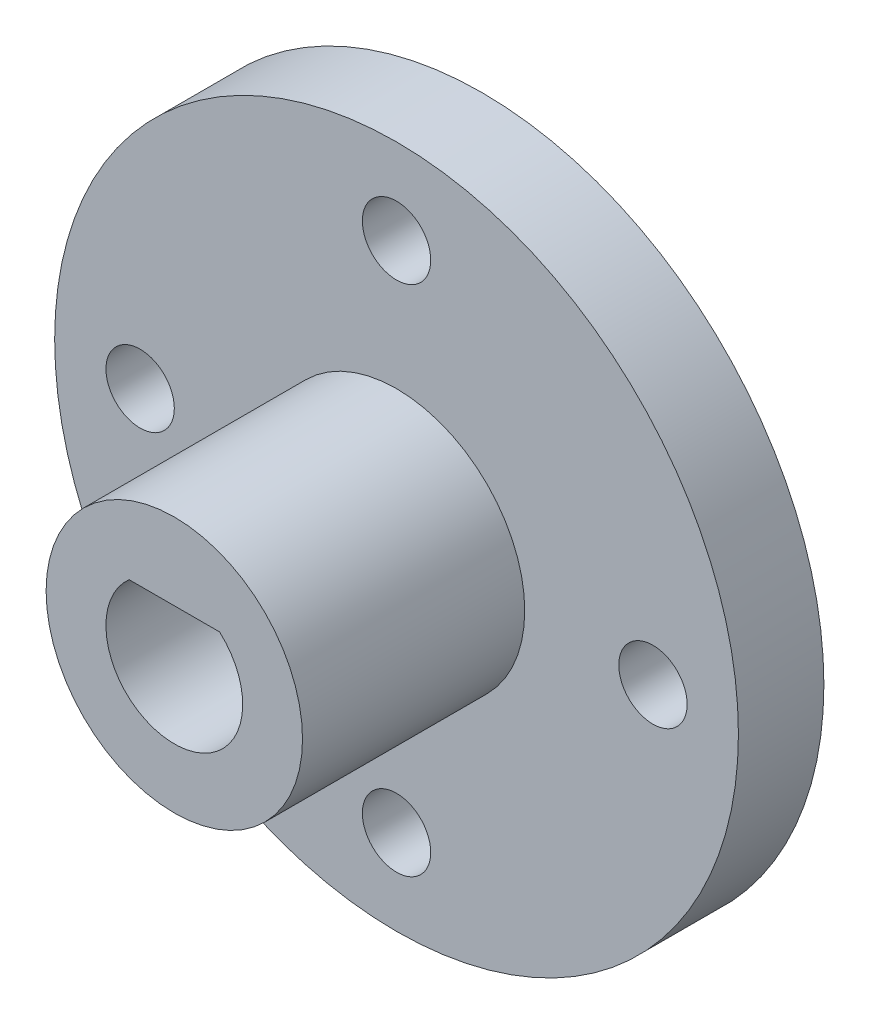
ISO-10303-21;
HEADER;
FILE_DESCRIPTION(('STEP AP214'),'2;1');
FILE_NAME('part.step','',(''),(''),'','','');
FILE_SCHEMA(('AUTOMOTIVE_DESIGN { 1 0 10303 214 1 1 1 1 }'));
ENDSEC;
DATA;
#1=APPLICATION_CONTEXT('core data for automotive mechanical design processes');
#2=APPLICATION_PROTOCOL_DEFINITION('international standard','automotive_design',2000,#1);
#3=PRODUCT_CONTEXT('',#1,'mechanical');
#4=PRODUCT('Part','Part','',(#3));
#5=PRODUCT_RELATED_PRODUCT_CATEGORY('part','',(#4));
#6=PRODUCT_DEFINITION_FORMATION('','',#4);
#7=PRODUCT_DEFINITION_CONTEXT('part definition',#1,'design');
#8=PRODUCT_DEFINITION('design','',#6,#7);
#9=PRODUCT_DEFINITION_SHAPE('','',#8);
#10=(LENGTH_UNIT() NAMED_UNIT(*) SI_UNIT(.MILLI.,.METRE.));
#11=(NAMED_UNIT(*) PLANE_ANGLE_UNIT() SI_UNIT($,.RADIAN.));
#12=(NAMED_UNIT(*) SI_UNIT($,.STERADIAN.) SOLID_ANGLE_UNIT());
#13=UNCERTAINTY_MEASURE_WITH_UNIT(LENGTH_MEASURE(1.E-05),#10,'distance_accuracy_value','');
#14=(GEOMETRIC_REPRESENTATION_CONTEXT(3) GLOBAL_UNCERTAINTY_ASSIGNED_CONTEXT((#13)) GLOBAL_UNIT_ASSIGNED_CONTEXT((#10,
#11,#12)) REPRESENTATION_CONTEXT('',''));
#15=CARTESIAN_POINT('',(0.,0.,0.));
#16=DIRECTION('',(0.,0.,1.));
#17=DIRECTION('',(1.,0.,0.));
#18=AXIS2_PLACEMENT_3D('',#15,#16,#17);
#19=CARTESIAN_POINT('',(0.,0.,5.));
#20=DIRECTION('',(0.,0.,-1.));
#21=DIRECTION('',(-1.,0.,0.));
#22=AXIS2_PLACEMENT_3D('',#19,#20,#21);
#23=CYLINDRICAL_SURFACE('',#22,20.);
#24=CARTESIAN_POINT('',(0.,0.,5.));
#25=DIRECTION('',(0.,0.,1.));
#26=DIRECTION('',(1.,0.,0.));
#27=AXIS2_PLACEMENT_3D('',#24,#25,#26);
#28=CIRCLE('',#27,20.);
#29=CARTESIAN_POINT('',(20.,0.,5.));
#30=VERTEX_POINT('',#29);
#31=EDGE_CURVE('E52',#30,#30,#28,.T.);
#32=ORIENTED_EDGE('',*,*,#31,.F.);
#33=EDGE_LOOP('',(#32));
#34=FACE_BOUND('',#33,.T.);
#35=CARTESIAN_POINT('',(0.,0.,0.));
#36=DIRECTION('',(0.,0.,1.));
#37=DIRECTION('',(1.,0.,0.));
#38=AXIS2_PLACEMENT_3D('',#35,#36,#37);
#39=CIRCLE('',#38,20.);
#40=CARTESIAN_POINT('',(20.,0.,0.));
#41=VERTEX_POINT('',#40);
#42=EDGE_CURVE('E101',#41,#41,#39,.T.);
#43=ORIENTED_EDGE('',*,*,#42,.T.);
#44=EDGE_LOOP('',(#43));
#45=FACE_BOUND('',#44,.T.);
#46=ADVANCED_FACE('F43',(#34,#45),#23,.T.);
#47=CARTESIAN_POINT('',(0.,0.,5.));
#48=DIRECTION('',(0.,0.,1.));
#49=DIRECTION('',(1.,0.,0.));
#50=AXIS2_PLACEMENT_3D('',#47,#48,#49);
#51=PLANE('',#50);
#52=CARTESIAN_POINT('',(0.,15.,5.));
#53=DIRECTION('',(0.,0.,1.));
#54=DIRECTION('',(1.,0.,0.));
#55=AXIS2_PLACEMENT_3D('',#52,#53,#54);
#56=CIRCLE('',#55,2.);
#57=CARTESIAN_POINT('',(2.,15.,5.));
#58=VERTEX_POINT('',#57);
#59=EDGE_CURVE('E114',#58,#58,#56,.T.);
#60=ORIENTED_EDGE('',*,*,#59,.F.);
#61=EDGE_LOOP('',(#60));
#62=FACE_BOUND('',#61,.T.);
#63=CARTESIAN_POINT('',(15.0000000000004,4.23570186157979E-13,5.));
#64=DIRECTION('',(0.,0.,1.));
#65=DIRECTION('',(1.,0.,0.));
#66=AXIS2_PLACEMENT_3D('',#63,#64,#65);
#67=CIRCLE('',#66,2.00000000000033);
#68=CARTESIAN_POINT('',(17.0000000000008,4.23570186157979E-13,5.));
#69=VERTEX_POINT('',#68);
#70=EDGE_CURVE('E187',#69,#69,#67,.T.);
#71=ORIENTED_EDGE('',*,*,#70,.F.);
#72=EDGE_LOOP('',(#71));
#73=FACE_BOUND('',#72,.T.);
#74=CARTESIAN_POINT('',(8.47140372315957E-13,-15.,5.));
#75=DIRECTION('',(0.,0.,1.));
#76=DIRECTION('',(1.,0.,0.));
#77=AXIS2_PLACEMENT_3D('',#74,#75,#76);
#78=CIRCLE('',#77,2.00000000000091);
#79=CARTESIAN_POINT('',(2.00000000000176,-15.,5.));
#80=VERTEX_POINT('',#79);
#81=EDGE_CURVE('E183',#80,#80,#78,.T.);
#82=ORIENTED_EDGE('',*,*,#81,.F.);
#83=EDGE_LOOP('',(#82));
#84=FACE_BOUND('',#83,.T.);
#85=CARTESIAN_POINT('',(-14.9999999999996,-4.254071563567E-13,5.));
#86=DIRECTION('',(0.,0.,1.));
#87=DIRECTION('',(1.,0.,0.));
#88=AXIS2_PLACEMENT_3D('',#85,#86,#87);
#89=CIRCLE('',#88,2.00000000000068);
#90=CARTESIAN_POINT('',(-12.9999999999989,-4.254071563567E-13,5.));
#91=VERTEX_POINT('',#90);
#92=EDGE_CURVE('E174',#91,#91,#89,.T.);
#93=ORIENTED_EDGE('',*,*,#92,.F.);
#94=EDGE_LOOP('',(#93));
#95=FACE_BOUND('',#94,.T.);
#96=CARTESIAN_POINT('',(0.,0.,5.));
#97=DIRECTION('',(0.,0.,1.));
#98=DIRECTION('',(1.,0.,0.));
#99=AXIS2_PLACEMENT_3D('',#96,#97,#98);
#100=CIRCLE('',#99,7.5);
#101=CARTESIAN_POINT('',(7.5,0.,5.));
#102=VERTEX_POINT('',#101);
#103=EDGE_CURVE('E11',#102,#102,#100,.T.);
#104=ORIENTED_EDGE('',*,*,#103,.F.);
#105=EDGE_LOOP('',(#104));
#106=FACE_BOUND('',#105,.T.);
#107=ORIENTED_EDGE('',*,*,#31,.T.);
#108=EDGE_LOOP('',(#107));
#109=FACE_BOUND('',#108,.T.);
#110=ADVANCED_FACE('F141',(#62,#73,#84,#95,#106,#109),#51,.T.);
#111=CARTESIAN_POINT('',(0.,0.,0.));
#112=DIRECTION('',(0.,0.,1.));
#113=DIRECTION('',(1.,0.,0.));
#114=AXIS2_PLACEMENT_3D('',#111,#112,#113);
#115=PLANE('',#114);
#116=CARTESIAN_POINT('',(0.,15.,0.));
#117=DIRECTION('',(0.,0.,1.));
#118=DIRECTION('',(1.,0.,0.));
#119=AXIS2_PLACEMENT_3D('',#116,#117,#118);
#120=CIRCLE('',#119,2.);
#121=CARTESIAN_POINT('',(2.,15.,0.));
#122=VERTEX_POINT('',#121);
#123=EDGE_CURVE('E46',#122,#122,#120,.T.);
#124=ORIENTED_EDGE('',*,*,#123,.T.);
#125=EDGE_LOOP('',(#124));
#126=FACE_BOUND('',#125,.T.);
#127=CARTESIAN_POINT('',(15.0000000000004,4.23570186157979E-13,0.));
#128=DIRECTION('',(0.,0.,1.));
#129=DIRECTION('',(1.,0.,0.));
#130=AXIS2_PLACEMENT_3D('',#127,#128,#129);
#131=CIRCLE('',#130,2.00000000000033);
#132=CARTESIAN_POINT('',(17.0000000000008,4.23570186157979E-13,0.));
#133=VERTEX_POINT('',#132);
#134=EDGE_CURVE('E92',#133,#133,#131,.T.);
#135=ORIENTED_EDGE('',*,*,#134,.T.);
#136=EDGE_LOOP('',(#135));
#137=FACE_BOUND('',#136,.T.);
#138=CARTESIAN_POINT('',(8.47140372315957E-13,-15.,0.));
#139=DIRECTION('',(0.,0.,1.));
#140=DIRECTION('',(1.,0.,0.));
#141=AXIS2_PLACEMENT_3D('',#138,#139,#140);
#142=CIRCLE('',#141,2.00000000000091);
#143=CARTESIAN_POINT('',(2.00000000000176,-15.,0.));
#144=VERTEX_POINT('',#143);
#145=EDGE_CURVE('E113',#144,#144,#142,.T.);
#146=ORIENTED_EDGE('',*,*,#145,.T.);
#147=EDGE_LOOP('',(#146));
#148=FACE_BOUND('',#147,.T.);
#149=CARTESIAN_POINT('',(-14.9999999999996,-4.254071563567E-13,0.));
#150=DIRECTION('',(0.,0.,1.));
#151=DIRECTION('',(1.,0.,0.));
#152=AXIS2_PLACEMENT_3D('',#149,#150,#151);
#153=CIRCLE('',#152,2.00000000000068);
#154=CARTESIAN_POINT('',(-12.9999999999989,-4.254071563567E-13,0.));
#155=VERTEX_POINT('',#154);
#156=EDGE_CURVE('E109',#155,#155,#153,.T.);
#157=ORIENTED_EDGE('',*,*,#156,.T.);
#158=EDGE_LOOP('',(#157));
#159=FACE_BOUND('',#158,.T.);
#160=DIRECTION('',(-1.,0.,0.));
#161=VECTOR('',#160,1.);
#162=CARTESIAN_POINT('',(-2.64575131106459,3.,0.));
#163=LINE('',#162,#161);
#164=CARTESIAN_POINT('',(2.64575131106459,3.,0.));
#165=VERTEX_POINT('',#164);
#166=CARTESIAN_POINT('',(-2.64575131106459,3.,0.));
#167=VERTEX_POINT('',#166);
#168=EDGE_CURVE('E94',#165,#167,#163,.T.);
#169=ORIENTED_EDGE('',*,*,#168,.T.);
#170=CARTESIAN_POINT('',(0.,0.,0.));
#171=DIRECTION('',(0.,0.,1.));
#172=DIRECTION('',(1.,0.,0.));
#173=AXIS2_PLACEMENT_3D('',#170,#171,#172);
#174=CIRCLE('',#173,4.);
#175=EDGE_CURVE('E60',#167,#165,#174,.T.);
#176=ORIENTED_EDGE('',*,*,#175,.T.);
#177=EDGE_LOOP('',(#169,#176));
#178=FACE_BOUND('',#177,.T.);
#179=ORIENTED_EDGE('',*,*,#42,.F.);
#180=EDGE_LOOP('',(#179));
#181=FACE_BOUND('',#180,.T.);
#182=ADVANCED_FACE('F121',(#126,#137,#148,#159,#178,#181),#115,.F.);
#183=CARTESIAN_POINT('',(0.,0.,18.));
#184=DIRECTION('',(0.,0.,-1.));
#185=DIRECTION('',(-1.,0.,0.));
#186=AXIS2_PLACEMENT_3D('',#183,#184,#185);
#187=CYLINDRICAL_SURFACE('',#186,7.5);
#188=CARTESIAN_POINT('',(0.,0.,18.));
#189=DIRECTION('',(0.,0.,1.));
#190=DIRECTION('',(1.,0.,0.));
#191=AXIS2_PLACEMENT_3D('',#188,#189,#190);
#192=CIRCLE('',#191,7.5);
#193=CARTESIAN_POINT('',(7.5,0.,18.));
#194=VERTEX_POINT('',#193);
#195=EDGE_CURVE('E77',#194,#194,#192,.T.);
#196=ORIENTED_EDGE('',*,*,#195,.F.);
#197=EDGE_LOOP('',(#196));
#198=FACE_BOUND('',#197,.T.);
#199=ORIENTED_EDGE('',*,*,#103,.T.);
#200=EDGE_LOOP('',(#199));
#201=FACE_BOUND('',#200,.T.);
#202=ADVANCED_FACE('F153',(#198,#201),#187,.T.);
#203=CARTESIAN_POINT('',(0.,0.,18.));
#204=DIRECTION('',(0.,0.,1.));
#205=DIRECTION('',(1.,0.,0.));
#206=AXIS2_PLACEMENT_3D('',#203,#204,#205);
#207=PLANE('',#206);
#208=CARTESIAN_POINT('',(0.,0.,18.));
#209=DIRECTION('',(0.,0.,1.));
#210=DIRECTION('',(1.,0.,0.));
#211=AXIS2_PLACEMENT_3D('',#208,#209,#210);
#212=CIRCLE('',#211,4.);
#213=CARTESIAN_POINT('',(-2.64575131106459,3.,18.));
#214=VERTEX_POINT('',#213);
#215=CARTESIAN_POINT('',(2.64575131106459,3.,18.));
#216=VERTEX_POINT('',#215);
#217=EDGE_CURVE('E65',#214,#216,#212,.T.);
#218=ORIENTED_EDGE('',*,*,#217,.F.);
#219=DIRECTION('',(-1.,0.,0.));
#220=VECTOR('',#219,1.);
#221=CARTESIAN_POINT('',(-2.64575131106459,3.,18.));
#222=LINE('',#221,#220);
#223=EDGE_CURVE('E81',#216,#214,#222,.T.);
#224=ORIENTED_EDGE('',*,*,#223,.F.);
#225=EDGE_LOOP('',(#218,#224));
#226=FACE_BOUND('',#225,.T.);
#227=ORIENTED_EDGE('',*,*,#195,.T.);
#228=EDGE_LOOP('',(#227));
#229=FACE_BOUND('',#228,.T.);
#230=ADVANCED_FACE('F86',(#226,#229),#207,.T.);
#231=CARTESIAN_POINT('',(0.,0.,0.));
#232=DIRECTION('',(0.,0.,1.));
#233=DIRECTION('',(1.,0.,0.));
#234=AXIS2_PLACEMENT_3D('',#231,#232,#233);
#235=CYLINDRICAL_SURFACE('',#234,4.);
#236=ORIENTED_EDGE('',*,*,#217,.T.);
#237=DIRECTION('',(0.,0.,1.));
#238=VECTOR('',#237,1.);
#239=CARTESIAN_POINT('',(2.64575131106459,3.,0.));
#240=LINE('',#239,#238);
#241=EDGE_CURVE('E78',#165,#216,#240,.T.);
#242=ORIENTED_EDGE('',*,*,#241,.F.);
#243=ORIENTED_EDGE('',*,*,#175,.F.);
#244=DIRECTION('',(0.,0.,1.));
#245=VECTOR('',#244,1.);
#246=CARTESIAN_POINT('',(-2.64575131106459,3.,0.));
#247=LINE('',#246,#245);
#248=EDGE_CURVE('E70',#167,#214,#247,.T.);
#249=ORIENTED_EDGE('',*,*,#248,.T.);
#250=EDGE_LOOP('',(#236,#242,#243,#249));
#251=FACE_BOUND('',#250,.T.);
#252=ADVANCED_FACE('F72',(#251),#235,.F.);
#253=CARTESIAN_POINT('',(-2.64575131106459,3.,0.));
#254=DIRECTION('',(0.,1.,0.));
#255=DIRECTION('',(0.,0.,1.));
#256=AXIS2_PLACEMENT_3D('',#253,#254,#255);
#257=PLANE('',#256);
#258=ORIENTED_EDGE('',*,*,#223,.T.);
#259=ORIENTED_EDGE('',*,*,#248,.F.);
#260=ORIENTED_EDGE('',*,*,#168,.F.);
#261=ORIENTED_EDGE('',*,*,#241,.T.);
#262=EDGE_LOOP('',(#258,#259,#260,#261));
#263=FACE_BOUND('',#262,.T.);
#264=ADVANCED_FACE('F82',(#263),#257,.F.);
#265=CARTESIAN_POINT('',(-14.9999999999996,-4.254071563567E-13,-13.));
#266=DIRECTION('',(0.,0.,1.));
#267=DIRECTION('',(1.,0.,0.));
#268=AXIS2_PLACEMENT_3D('',#265,#266,#267);
#269=CYLINDRICAL_SURFACE('',#268,2.00000000000068);
#270=ORIENTED_EDGE('',*,*,#92,.T.);
#271=EDGE_LOOP('',(#270));
#272=FACE_BOUND('',#271,.T.);
#273=ORIENTED_EDGE('',*,*,#156,.F.);
#274=EDGE_LOOP('',(#273));
#275=FACE_BOUND('',#274,.T.);
#276=ADVANCED_FACE('F136',(#272,#275),#269,.F.);
#277=CARTESIAN_POINT('',(8.47140372315957E-13,-15.,-13.));
#278=DIRECTION('',(0.,0.,1.));
#279=DIRECTION('',(1.,0.,0.));
#280=AXIS2_PLACEMENT_3D('',#277,#278,#279);
#281=CYLINDRICAL_SURFACE('',#280,2.00000000000091);
#282=ORIENTED_EDGE('',*,*,#81,.T.);
#283=EDGE_LOOP('',(#282));
#284=FACE_BOUND('',#283,.T.);
#285=ORIENTED_EDGE('',*,*,#145,.F.);
#286=EDGE_LOOP('',(#285));
#287=FACE_BOUND('',#286,.T.);
#288=ADVANCED_FACE('F127',(#284,#287),#281,.F.);
#289=CARTESIAN_POINT('',(15.0000000000004,4.23570186157979E-13,-13.));
#290=DIRECTION('',(0.,0.,1.));
#291=DIRECTION('',(1.,0.,0.));
#292=AXIS2_PLACEMENT_3D('',#289,#290,#291);
#293=CYLINDRICAL_SURFACE('',#292,2.00000000000033);
#294=ORIENTED_EDGE('',*,*,#70,.T.);
#295=EDGE_LOOP('',(#294));
#296=FACE_BOUND('',#295,.T.);
#297=ORIENTED_EDGE('',*,*,#134,.F.);
#298=EDGE_LOOP('',(#297));
#299=FACE_BOUND('',#298,.T.);
#300=ADVANCED_FACE('F124',(#296,#299),#293,.F.);
#301=CARTESIAN_POINT('',(0.,15.,-13.));
#302=DIRECTION('',(0.,0.,1.));
#303=DIRECTION('',(1.,0.,0.));
#304=AXIS2_PLACEMENT_3D('',#301,#302,#303);
#305=CYLINDRICAL_SURFACE('',#304,2.);
#306=ORIENTED_EDGE('',*,*,#59,.T.);
#307=EDGE_LOOP('',(#306));
#308=FACE_BOUND('',#307,.T.);
#309=ORIENTED_EDGE('',*,*,#123,.F.);
#310=EDGE_LOOP('',(#309));
#311=FACE_BOUND('',#310,.T.);
#312=ADVANCED_FACE('F126',(#308,#311),#305,.F.);
#313=CLOSED_SHELL('',(#46,#110,#182,#202,#230,#252,#264,#276,#288,#300,#312));
#314=MANIFOLD_SOLID_BREP('B2',#313);
#315=ADVANCED_BREP_SHAPE_REPRESENTATION('',(#18,#314),#14);
#316=SHAPE_DEFINITION_REPRESENTATION(#9,#315);
ENDSEC;
END-ISO-10303-21;
